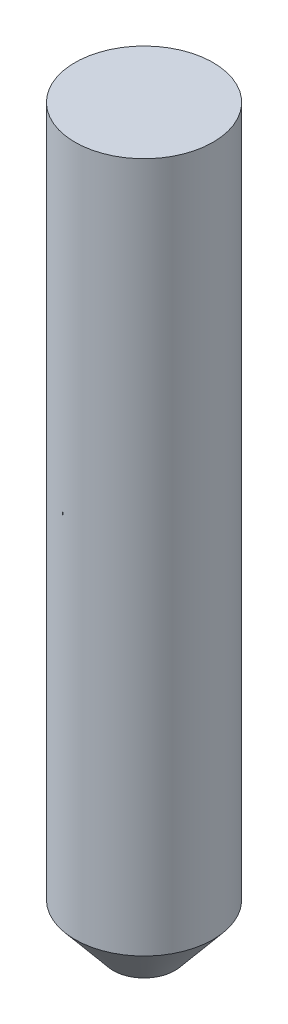
ISO-10303-21;
HEADER;
FILE_DESCRIPTION(('STEP AP214'),'2;1');
FILE_NAME('part.step','',(''),(''),'','','');
FILE_SCHEMA(('AUTOMOTIVE_DESIGN { 1 0 10303 214 1 1 1 1 }'));
ENDSEC;
DATA;
#1=APPLICATION_CONTEXT('core data for automotive mechanical design processes');
#2=APPLICATION_PROTOCOL_DEFINITION('international standard','automotive_design',2000,#1);
#3=PRODUCT_CONTEXT('',#1,'mechanical');
#4=PRODUCT('Part','Part','',(#3));
#5=PRODUCT_RELATED_PRODUCT_CATEGORY('part','',(#4));
#6=PRODUCT_DEFINITION_FORMATION('','',#4);
#7=PRODUCT_DEFINITION_CONTEXT('part definition',#1,'design');
#8=PRODUCT_DEFINITION('design','',#6,#7);
#9=PRODUCT_DEFINITION_SHAPE('','',#8);
#10=(LENGTH_UNIT() NAMED_UNIT(*) SI_UNIT(.MILLI.,.METRE.));
#11=(NAMED_UNIT(*) PLANE_ANGLE_UNIT() SI_UNIT($,.RADIAN.));
#12=(NAMED_UNIT(*) SI_UNIT($,.STERADIAN.) SOLID_ANGLE_UNIT());
#13=UNCERTAINTY_MEASURE_WITH_UNIT(LENGTH_MEASURE(1.E-05),#10,'distance_accuracy_value','');
#14=(GEOMETRIC_REPRESENTATION_CONTEXT(3) GLOBAL_UNCERTAINTY_ASSIGNED_CONTEXT((#13)) GLOBAL_UNIT_ASSIGNED_CONTEXT((#10,
#11,#12)) REPRESENTATION_CONTEXT('',''));
#15=CARTESIAN_POINT('',(0.,0.,0.));
#16=DIRECTION('',(0.,0.,1.));
#17=DIRECTION('',(1.,0.,0.));
#18=AXIS2_PLACEMENT_3D('',#15,#16,#17);
#19=CARTESIAN_POINT('',(3.23650456939268E-12,-943.518843805212,0.));
#20=DIRECTION('',(0.,-1.,0.));
#21=DIRECTION('',(1.,0.,0.));
#22=AXIS2_PLACEMENT_3D('',#19,#20,#21);
#23=CYLINDRICAL_SURFACE('',#22,12.5000000000005);
#24=CARTESIAN_POINT('',(5.14537349832865E-13,-150.,0.));
#25=DIRECTION('',(0.,-1.,0.));
#26=DIRECTION('',(1.,0.,0.));
#27=AXIS2_PLACEMENT_3D('',#24,#25,#26);
#28=CIRCLE('',#27,12.5000000000005);
#29=CARTESIAN_POINT('',(12.500000000001,-150.,0.));
#30=VERTEX_POINT('',#29);
#31=EDGE_CURVE('E133',#30,#30,#28,.T.);
#32=ORIENTED_EDGE('',*,*,#31,.T.);
#33=EDGE_LOOP('',(#32));
#34=FACE_BOUND('',#33,.T.);
#35=CARTESIAN_POINT('',(4.80234859844007E-13,-140.,0.));
#36=DIRECTION('',(0.,-1.,0.));
#37=DIRECTION('',(1.,0.,0.));
#38=AXIS2_PLACEMENT_3D('',#35,#36,#37);
#39=CIRCLE('',#38,12.5000000000005);
#40=CARTESIAN_POINT('',(-12.5,-140.,0.));
#41=VERTEX_POINT('',#40);
#42=CARTESIAN_POINT('',(2.17060222083707,-140.,-12.3100969126531));
#43=VERTEX_POINT('',#42);
#44=EDGE_CURVE('E11',#41,#43,#39,.T.);
#45=ORIENTED_EDGE('',*,*,#44,.F.);
#46=DIRECTION('',(0.,-1.,0.));
#47=VECTOR('',#46,1.);
#48=CARTESIAN_POINT('',(-12.5,0.,0.));
#49=LINE('',#48,#47);
#50=CARTESIAN_POINT('',(-12.5,-10.,0.));
#51=VERTEX_POINT('',#50);
#52=EDGE_CURVE('E102',#51,#41,#49,.T.);
#53=ORIENTED_EDGE('',*,*,#52,.F.);
#54=CARTESIAN_POINT('',(0.,-9.9999999999999,0.));
#55=DIRECTION('',(0.,-1.,0.));
#56=DIRECTION('',(1.,0.,0.));
#57=AXIS2_PLACEMENT_3D('',#54,#55,#56);
#58=CIRCLE('',#57,12.5);
#59=CARTESIAN_POINT('',(2.17060222083655,-9.99999999999995,-12.3100969126527));
#60=VERTEX_POINT('',#59);
#61=EDGE_CURVE('E100',#60,#51,#58,.T.);
#62=ORIENTED_EDGE('',*,*,#61,.F.);
#63=DIRECTION('',(0.,-1.,0.));
#64=VECTOR('',#63,1.);
#65=CARTESIAN_POINT('',(2.17060222083651,0.,-12.3100969126526));
#66=LINE('',#65,#64);
#67=EDGE_CURVE('E120',#60,#43,#66,.T.);
#68=ORIENTED_EDGE('',*,*,#67,.T.);
#69=EDGE_LOOP('',(#45,#53,#62,#68));
#70=FACE_BOUND('',#69,.T.);
#71=ADVANCED_FACE('F47',(#34,#70),#23,.F.);
#72=CARTESIAN_POINT('',(0.,-140.,0.));
#73=DIRECTION('',(0.,-1.,0.));
#74=DIRECTION('',(1.,0.,0.));
#75=AXIS2_PLACEMENT_3D('',#72,#73,#74);
#76=PLANE('',#75);
#77=ORIENTED_EDGE('',*,*,#44,.T.);
#78=DIRECTION('',(0.173648177666921,0.,-0.98480775301221));
#79=VECTOR('',#78,1.);
#80=CARTESIAN_POINT('',(5.63626768108048E-13,-140.,-4.7293901324111E-13));
#81=LINE('',#80,#79);
#82=CARTESIAN_POINT('',(2.60472266500437,-140.,-14.7721162951836));
#83=VERTEX_POINT('',#82);
#84=EDGE_CURVE('E128',#43,#83,#81,.T.);
#85=ORIENTED_EDGE('',*,*,#84,.T.);
#86=CARTESIAN_POINT('',(4.80234859844007E-13,-140.,0.));
#87=DIRECTION('',(0.,-1.,0.));
#88=DIRECTION('',(1.,0.,0.));
#89=AXIS2_PLACEMENT_3D('',#86,#87,#88);
#90=CIRCLE('',#89,15.0000000000005);
#91=CARTESIAN_POINT('',(-15.,-140.,0.));
#92=VERTEX_POINT('',#91);
#93=EDGE_CURVE('E55',#92,#83,#90,.T.);
#94=ORIENTED_EDGE('',*,*,#93,.F.);
#95=DIRECTION('',(-1.,0.,0.));
#96=VECTOR('',#95,1.);
#97=CARTESIAN_POINT('',(0.,-140.,0.));
#98=LINE('',#97,#96);
#99=EDGE_CURVE('E65',#41,#92,#98,.T.);
#100=ORIENTED_EDGE('',*,*,#99,.F.);
#101=EDGE_LOOP('',(#77,#85,#94,#100));
#102=FACE_BOUND('',#101,.T.);
#103=ADVANCED_FACE('F163',(#102),#76,.F.);
#104=CARTESIAN_POINT('',(3.23650456939268E-12,-943.518843805212,0.));
#105=DIRECTION('',(0.,-1.,0.));
#106=DIRECTION('',(1.,0.,0.));
#107=AXIS2_PLACEMENT_3D('',#104,#105,#106);
#108=CYLINDRICAL_SURFACE('',#107,15.0000000000005);
#109=CARTESIAN_POINT('',(5.14537349832865E-13,-150.,0.));
#110=DIRECTION('',(0.,-1.,0.));
#111=DIRECTION('',(1.,0.,0.));
#112=AXIS2_PLACEMENT_3D('',#109,#110,#111);
#113=CIRCLE('',#112,15.0000000000005);
#114=CARTESIAN_POINT('',(15.000000000001,-150.,0.));
#115=VERTEX_POINT('',#114);
#116=EDGE_CURVE('E153',#115,#115,#113,.T.);
#117=ORIENTED_EDGE('',*,*,#116,.F.);
#118=EDGE_LOOP('',(#117));
#119=FACE_BOUND('',#118,.T.);
#120=ORIENTED_EDGE('',*,*,#93,.T.);
#121=DIRECTION('',(0.,-1.,0.));
#122=VECTOR('',#121,1.);
#123=CARTESIAN_POINT('',(2.60472266500381,0.,-14.7721162951831));
#124=LINE('',#123,#122);
#125=CARTESIAN_POINT('',(2.60472266500385,-9.99999999999994,-14.7721162951832));
#126=VERTEX_POINT('',#125);
#127=EDGE_CURVE('E108',#126,#83,#124,.T.);
#128=ORIENTED_EDGE('',*,*,#127,.F.);
#129=CARTESIAN_POINT('',(0.,-10.,0.));
#130=DIRECTION('',(0.,-1.,0.));
#131=DIRECTION('',(1.,0.,0.));
#132=AXIS2_PLACEMENT_3D('',#129,#130,#131);
#133=CIRCLE('',#132,15.);
#134=CARTESIAN_POINT('',(-15.,-10.,0.));
#135=VERTEX_POINT('',#134);
#136=EDGE_CURVE('E99',#135,#126,#133,.T.);
#137=ORIENTED_EDGE('',*,*,#136,.F.);
#138=DIRECTION('',(0.,-1.,0.));
#139=VECTOR('',#138,1.);
#140=CARTESIAN_POINT('',(-15.,0.,0.));
#141=LINE('',#140,#139);
#142=EDGE_CURVE('E84',#135,#92,#141,.T.);
#143=ORIENTED_EDGE('',*,*,#142,.T.);
#144=EDGE_LOOP('',(#120,#128,#137,#143));
#145=FACE_BOUND('',#144,.T.);
#146=CARTESIAN_POINT('',(0.,0.,0.));
#147=DIRECTION('',(0.,-1.,0.));
#148=DIRECTION('',(1.,0.,0.));
#149=AXIS2_PLACEMENT_3D('',#146,#147,#148);
#150=CIRCLE('',#149,15.);
#151=CARTESIAN_POINT('',(15.,0.,0.));
#152=VERTEX_POINT('',#151);
#153=EDGE_CURVE('E110',#152,#152,#150,.T.);
#154=ORIENTED_EDGE('',*,*,#153,.T.);
#155=EDGE_LOOP('',(#154));
#156=FACE_BOUND('',#155,.T.);
#157=ADVANCED_FACE('F105',(#119,#145,#156),#108,.T.);
#158=CARTESIAN_POINT('',(5.14537349832865E-13,-150.,0.));
#159=DIRECTION('',(0.,1.,0.));
#160=DIRECTION('',(-1.,0.,0.));
#161=AXIS2_PLACEMENT_3D('',#158,#159,#160);
#162=CONICAL_SURFACE('',#161,15.0000000000005,0.693159907576754);
#163=CARTESIAN_POINT('',(5.48839839821722E-13,-160.,0.));
#164=DIRECTION('',(0.,-1.,0.));
#165=DIRECTION('',(1.,0.,0.));
#166=AXIS2_PLACEMENT_3D('',#163,#164,#165);
#167=CIRCLE('',#166,6.69337613708241);
#168=CARTESIAN_POINT('',(6.69337613708296,-160.,0.));
#169=VERTEX_POINT('',#168);
#170=EDGE_CURVE('E149',#169,#169,#167,.T.);
#171=ORIENTED_EDGE('',*,*,#170,.F.);
#172=EDGE_LOOP('',(#171));
#173=FACE_BOUND('',#172,.T.);
#174=ORIENTED_EDGE('',*,*,#116,.T.);
#175=EDGE_LOOP('',(#174));
#176=FACE_BOUND('',#175,.T.);
#177=ADVANCED_FACE('F191',(#173,#176),#162,.T.);
#178=CARTESIAN_POINT('',(-2.22044604925031E-12,-160.,0.));
#179=DIRECTION('',(0.,1.,0.));
#180=DIRECTION('',(-1.,0.,0.));
#181=AXIS2_PLACEMENT_3D('',#178,#179,#180);
#182=PLANE('',#181);
#183=CARTESIAN_POINT('',(5.48839839821722E-13,-160.,0.));
#184=DIRECTION('',(0.,-1.,0.));
#185=DIRECTION('',(1.,0.,0.));
#186=AXIS2_PLACEMENT_3D('',#183,#184,#185);
#187=CIRCLE('',#186,4.69337613708243);
#188=CARTESIAN_POINT('',(4.69337613708298,-160.,0.));
#189=VERTEX_POINT('',#188);
#190=EDGE_CURVE('E145',#189,#189,#187,.T.);
#191=ORIENTED_EDGE('',*,*,#190,.F.);
#192=EDGE_LOOP('',(#191));
#193=FACE_BOUND('',#192,.T.);
#194=ORIENTED_EDGE('',*,*,#170,.T.);
#195=EDGE_LOOP('',(#194));
#196=FACE_BOUND('',#195,.T.);
#197=ADVANCED_FACE('F187',(#193,#196),#182,.F.);
#198=CARTESIAN_POINT('',(3.23650456939268E-12,-943.518843805212,0.));
#199=DIRECTION('',(0.,-1.,0.));
#200=DIRECTION('',(1.,0.,0.));
#201=AXIS2_PLACEMENT_3D('',#198,#199,#200);
#202=CYLINDRICAL_SURFACE('',#201,4.69337613708243);
#203=ORIENTED_EDGE('',*,*,#190,.T.);
#204=EDGE_LOOP('',(#203));
#205=FACE_BOUND('',#204,.T.);
#206=CARTESIAN_POINT('',(5.43694466323393E-13,-158.5,0.));
#207=DIRECTION('',(0.,-1.,0.));
#208=DIRECTION('',(1.,0.,0.));
#209=AXIS2_PLACEMENT_3D('',#206,#207,#208);
#210=CIRCLE('',#209,4.69337613708243);
#211=CARTESIAN_POINT('',(4.69337613708297,-158.5,0.));
#212=VERTEX_POINT('',#211);
#213=EDGE_CURVE('E141',#212,#212,#210,.T.);
#214=ORIENTED_EDGE('',*,*,#213,.F.);
#215=EDGE_LOOP('',(#214));
#216=FACE_BOUND('',#215,.T.);
#217=ADVANCED_FACE('F180',(#205,#216),#202,.F.);
#218=CARTESIAN_POINT('',(0.,-158.5,0.));
#219=DIRECTION('',(0.,1.,0.));
#220=DIRECTION('',(-1.,0.,0.));
#221=AXIS2_PLACEMENT_3D('',#218,#219,#220);
#222=PLANE('',#221);
#223=ORIENTED_EDGE('',*,*,#213,.T.);
#224=EDGE_LOOP('',(#223));
#225=FACE_BOUND('',#224,.T.);
#226=CARTESIAN_POINT('',(5.43694466323393E-13,-158.5,0.));
#227=DIRECTION('',(0.,-1.,0.));
#228=DIRECTION('',(1.,0.,0.));
#229=AXIS2_PLACEMENT_3D('',#226,#227,#228);
#230=CIRCLE('',#229,6.33558599703155);
#231=CARTESIAN_POINT('',(6.33558599703209,-158.5,0.));
#232=VERTEX_POINT('',#231);
#233=EDGE_CURVE('E137',#232,#232,#230,.T.);
#234=ORIENTED_EDGE('',*,*,#233,.F.);
#235=EDGE_LOOP('',(#234));
#236=FACE_BOUND('',#235,.T.);
#237=ADVANCED_FACE('F172',(#225,#236),#222,.T.);
#238=CARTESIAN_POINT('',(5.14537349832865E-13,-150.,0.));
#239=DIRECTION('',(0.,1.,0.));
#240=DIRECTION('',(-1.,0.,0.));
#241=AXIS2_PLACEMENT_3D('',#238,#239,#240);
#242=CONICAL_SURFACE('',#241,12.5000000000005,0.627455772923191);
#243=ORIENTED_EDGE('',*,*,#233,.T.);
#244=EDGE_LOOP('',(#243));
#245=FACE_BOUND('',#244,.T.);
#246=ORIENTED_EDGE('',*,*,#31,.F.);
#247=EDGE_LOOP('',(#246));
#248=FACE_BOUND('',#247,.T.);
#249=ADVANCED_FACE('F171',(#245,#248),#242,.F.);
#250=CARTESIAN_POINT('',(0.,0.,0.));
#251=DIRECTION('',(-0.98480775301221,0.,-0.173648177666921));
#252=DIRECTION('',(-0.173648177666921,0.,0.98480775301221));
#253=AXIS2_PLACEMENT_3D('',#250,#251,#252);
#254=PLANE('',#253);
#255=ORIENTED_EDGE('',*,*,#67,.F.);
#256=DIRECTION('',(0.173648177666921,0.,-0.98480775301221));
#257=VECTOR('',#256,1.);
#258=CARTESIAN_POINT('',(0.,-9.99999999999999,0.));
#259=LINE('',#258,#257);
#260=EDGE_CURVE('E123',#60,#126,#259,.T.);
#261=ORIENTED_EDGE('',*,*,#260,.T.);
#262=ORIENTED_EDGE('',*,*,#127,.T.);
#263=ORIENTED_EDGE('',*,*,#84,.F.);
#264=EDGE_LOOP('',(#255,#261,#262,#263));
#265=FACE_BOUND('',#264,.T.);
#266=ADVANCED_FACE('F160',(#265),#254,.T.);
#267=CARTESIAN_POINT('',(0.,0.,0.));
#268=DIRECTION('',(0.,0.,1.));
#269=DIRECTION('',(1.,0.,0.));
#270=AXIS2_PLACEMENT_3D('',#267,#268,#269);
#271=PLANE('',#270);
#272=ORIENTED_EDGE('',*,*,#52,.T.);
#273=ORIENTED_EDGE('',*,*,#99,.T.);
#274=ORIENTED_EDGE('',*,*,#142,.F.);
#275=DIRECTION('',(-1.,0.,0.));
#276=VECTOR('',#275,1.);
#277=CARTESIAN_POINT('',(0.,-9.99999999999999,0.));
#278=LINE('',#277,#276);
#279=EDGE_CURVE('E88',#51,#135,#278,.T.);
#280=ORIENTED_EDGE('',*,*,#279,.F.);
#281=EDGE_LOOP('',(#272,#273,#274,#280));
#282=FACE_BOUND('',#281,.T.);
#283=ADVANCED_FACE('F87',(#282),#271,.F.);
#284=CARTESIAN_POINT('',(0.,-9.99999999999998,0.));
#285=DIRECTION('',(0.,-1.,0.));
#286=DIRECTION('',(1.,0.,0.));
#287=AXIS2_PLACEMENT_3D('',#284,#285,#286);
#288=PLANE('',#287);
#289=ORIENTED_EDGE('',*,*,#260,.F.);
#290=ORIENTED_EDGE('',*,*,#61,.T.);
#291=ORIENTED_EDGE('',*,*,#279,.T.);
#292=ORIENTED_EDGE('',*,*,#136,.T.);
#293=EDGE_LOOP('',(#289,#290,#291,#292));
#294=FACE_BOUND('',#293,.T.);
#295=ADVANCED_FACE('F98',(#294),#288,.T.);
#296=CARTESIAN_POINT('',(0.,0.,0.));
#297=DIRECTION('',(0.,-1.,0.));
#298=DIRECTION('',(1.,0.,0.));
#299=AXIS2_PLACEMENT_3D('',#296,#297,#298);
#300=PLANE('',#299);
#301=ORIENTED_EDGE('',*,*,#153,.F.);
#302=EDGE_LOOP('',(#301));
#303=FACE_BOUND('',#302,.T.);
#304=ADVANCED_FACE('F222',(#303),#300,.F.);
#305=CLOSED_SHELL('',(#71,#103,#157,#177,#197,#217,#237,#249,#266,#283,#295,#304));
#306=MANIFOLD_SOLID_BREP('B2',#305);
#307=ADVANCED_BREP_SHAPE_REPRESENTATION('',(#18,#306),#14);
#308=SHAPE_DEFINITION_REPRESENTATION(#9,#307);
ENDSEC;
END-ISO-10303-21;
